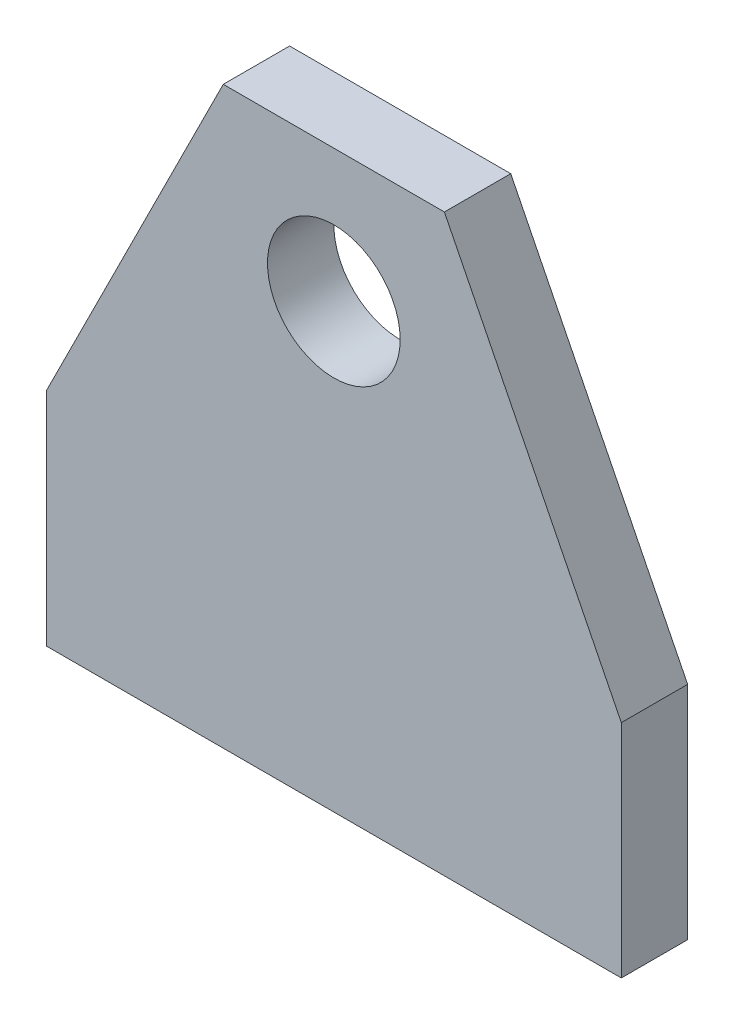
ISO-10303-21;
HEADER;
FILE_DESCRIPTION(('STEP AP214'),'2;1');
FILE_NAME('part.step','',(''),(''),'','','');
FILE_SCHEMA(('AUTOMOTIVE_DESIGN { 1 0 10303 214 1 1 1 1 }'));
ENDSEC;
DATA;
#1=APPLICATION_CONTEXT('core data for automotive mechanical design processes');
#2=APPLICATION_PROTOCOL_DEFINITION('international standard','automotive_design',2000,#1);
#3=PRODUCT_CONTEXT('',#1,'mechanical');
#4=PRODUCT('Part','Part','',(#3));
#5=PRODUCT_RELATED_PRODUCT_CATEGORY('part','',(#4));
#6=PRODUCT_DEFINITION_FORMATION('','',#4);
#7=PRODUCT_DEFINITION_CONTEXT('part definition',#1,'design');
#8=PRODUCT_DEFINITION('design','',#6,#7);
#9=PRODUCT_DEFINITION_SHAPE('','',#8);
#10=(LENGTH_UNIT() NAMED_UNIT(*) SI_UNIT(.MILLI.,.METRE.));
#11=(NAMED_UNIT(*) PLANE_ANGLE_UNIT() SI_UNIT($,.RADIAN.));
#12=(NAMED_UNIT(*) SI_UNIT($,.STERADIAN.) SOLID_ANGLE_UNIT());
#13=UNCERTAINTY_MEASURE_WITH_UNIT(LENGTH_MEASURE(1.E-05),#10,'distance_accuracy_value','');
#14=(GEOMETRIC_REPRESENTATION_CONTEXT(3) GLOBAL_UNCERTAINTY_ASSIGNED_CONTEXT((#13)) GLOBAL_UNIT_ASSIGNED_CONTEXT((#10,
#11,#12)) REPRESENTATION_CONTEXT('',''));
#15=CARTESIAN_POINT('',(0.,0.,0.));
#16=DIRECTION('',(0.,0.,1.));
#17=DIRECTION('',(1.,0.,0.));
#18=AXIS2_PLACEMENT_3D('',#15,#16,#17);
#19=CARTESIAN_POINT('',(41.275,0.,9.525));
#20=DIRECTION('',(0.,0.,-1.));
#21=DIRECTION('',(-1.,0.,0.));
#22=AXIS2_PLACEMENT_3D('',#19,#20,#21);
#23=PLANE('',#22);
#24=DIRECTION('',(0.,-1.,0.));
#25=VECTOR('',#24,1.);
#26=CARTESIAN_POINT('',(41.275,31.75,9.525));
#27=LINE('',#26,#25);
#28=CARTESIAN_POINT('',(41.275,31.75,9.525));
#29=VERTEX_POINT('',#28);
#30=CARTESIAN_POINT('',(41.275,0.,9.525));
#31=VERTEX_POINT('',#30);
#32=EDGE_CURVE('E162',#29,#31,#27,.T.);
#33=ORIENTED_EDGE('',*,*,#32,.F.);
#34=DIRECTION('',(0.447213595499958,-0.894427190999916,0.));
#35=VECTOR('',#34,1.);
#36=CARTESIAN_POINT('',(15.875,82.55,9.525));
#37=LINE('',#36,#35);
#38=CARTESIAN_POINT('',(15.875,82.55,9.525));
#39=VERTEX_POINT('',#38);
#40=EDGE_CURVE('E133',#39,#29,#37,.T.);
#41=ORIENTED_EDGE('',*,*,#40,.F.);
#42=DIRECTION('',(1.,0.,0.));
#43=VECTOR('',#42,1.);
#44=CARTESIAN_POINT('',(-15.875,82.55,9.525));
#45=LINE('',#44,#43);
#46=CARTESIAN_POINT('',(-15.875,82.55,9.525));
#47=VERTEX_POINT('',#46);
#48=EDGE_CURVE('E115',#47,#39,#45,.T.);
#49=ORIENTED_EDGE('',*,*,#48,.F.);
#50=DIRECTION('',(-0.447213595499958,-0.894427190999916,0.));
#51=VECTOR('',#50,1.);
#52=CARTESIAN_POINT('',(-15.875,82.55,9.525));
#53=LINE('',#52,#51);
#54=CARTESIAN_POINT('',(-41.275,31.75,9.525));
#55=VERTEX_POINT('',#54);
#56=EDGE_CURVE('E124',#47,#55,#53,.T.);
#57=ORIENTED_EDGE('',*,*,#56,.T.);
#58=DIRECTION('',(0.,-1.,0.));
#59=VECTOR('',#58,1.);
#60=CARTESIAN_POINT('',(-41.275,31.75,9.525));
#61=LINE('',#60,#59);
#62=CARTESIAN_POINT('',(-41.275,0.,9.525));
#63=VERTEX_POINT('',#62);
#64=EDGE_CURVE('E130',#55,#63,#61,.T.);
#65=ORIENTED_EDGE('',*,*,#64,.T.);
#66=DIRECTION('',(-1.,0.,0.));
#67=VECTOR('',#66,1.);
#68=CARTESIAN_POINT('',(41.275,0.,9.525));
#69=LINE('',#68,#67);
#70=EDGE_CURVE('E212',#31,#63,#69,.T.);
#71=ORIENTED_EDGE('',*,*,#70,.F.);
#72=EDGE_LOOP('',(#33,#41,#49,#57,#65,#71));
#73=FACE_BOUND('',#72,.T.);
#74=CARTESIAN_POINT('',(0.,63.5,9.525));
#75=DIRECTION('',(0.,0.,1.));
#76=DIRECTION('',(1.,0.,0.));
#77=AXIS2_PLACEMENT_3D('',#74,#75,#76);
#78=CIRCLE('',#77,9.525);
#79=CARTESIAN_POINT('',(9.525,63.5,9.525));
#80=VERTEX_POINT('',#79);
#81=EDGE_CURVE('E146',#80,#80,#78,.T.);
#82=ORIENTED_EDGE('',*,*,#81,.F.);
#83=EDGE_LOOP('',(#82));
#84=FACE_BOUND('',#83,.T.);
#85=ADVANCED_FACE('F40',(#73,#84),#23,.F.);
#86=CARTESIAN_POINT('',(41.275,0.,0.));
#87=DIRECTION('',(0.,0.,-1.));
#88=DIRECTION('',(-1.,0.,0.));
#89=AXIS2_PLACEMENT_3D('',#86,#87,#88);
#90=PLANE('',#89);
#91=DIRECTION('',(0.,-1.,0.));
#92=VECTOR('',#91,1.);
#93=CARTESIAN_POINT('',(41.275,31.75,0.));
#94=LINE('',#93,#92);
#95=CARTESIAN_POINT('',(41.275,31.75,0.));
#96=VERTEX_POINT('',#95);
#97=CARTESIAN_POINT('',(41.275,0.,0.));
#98=VERTEX_POINT('',#97);
#99=EDGE_CURVE('E141',#96,#98,#94,.T.);
#100=ORIENTED_EDGE('',*,*,#99,.T.);
#101=DIRECTION('',(-1.,0.,0.));
#102=VECTOR('',#101,1.);
#103=CARTESIAN_POINT('',(41.275,0.,0.));
#104=LINE('',#103,#102);
#105=CARTESIAN_POINT('',(-41.275,0.,0.));
#106=VERTEX_POINT('',#105);
#107=EDGE_CURVE('E145',#98,#106,#104,.T.);
#108=ORIENTED_EDGE('',*,*,#107,.T.);
#109=DIRECTION('',(0.,-1.,0.));
#110=VECTOR('',#109,1.);
#111=CARTESIAN_POINT('',(-41.275,31.75,0.));
#112=LINE('',#111,#110);
#113=CARTESIAN_POINT('',(-41.275,31.75,0.));
#114=VERTEX_POINT('',#113);
#115=EDGE_CURVE('E150',#114,#106,#112,.T.);
#116=ORIENTED_EDGE('',*,*,#115,.F.);
#117=DIRECTION('',(-0.447213595499958,-0.894427190999916,0.));
#118=VECTOR('',#117,1.);
#119=CARTESIAN_POINT('',(-15.875,82.55,0.));
#120=LINE('',#119,#118);
#121=CARTESIAN_POINT('',(-15.875,82.55,0.));
#122=VERTEX_POINT('',#121);
#123=EDGE_CURVE('E154',#122,#114,#120,.T.);
#124=ORIENTED_EDGE('',*,*,#123,.F.);
#125=DIRECTION('',(1.,0.,0.));
#126=VECTOR('',#125,1.);
#127=CARTESIAN_POINT('',(-15.875,82.55,0.));
#128=LINE('',#127,#126);
#129=CARTESIAN_POINT('',(15.875,82.55,0.));
#130=VERTEX_POINT('',#129);
#131=EDGE_CURVE('E117',#122,#130,#128,.T.);
#132=ORIENTED_EDGE('',*,*,#131,.T.);
#133=DIRECTION('',(0.447213595499958,-0.894427190999916,0.));
#134=VECTOR('',#133,1.);
#135=CARTESIAN_POINT('',(15.875,82.55,0.));
#136=LINE('',#135,#134);
#137=EDGE_CURVE('E159',#130,#96,#136,.T.);
#138=ORIENTED_EDGE('',*,*,#137,.T.);
#139=EDGE_LOOP('',(#100,#108,#116,#124,#132,#138));
#140=FACE_BOUND('',#139,.T.);
#141=CARTESIAN_POINT('',(0.,63.5,0.));
#142=DIRECTION('',(0.,0.,1.));
#143=DIRECTION('',(1.,0.,0.));
#144=AXIS2_PLACEMENT_3D('',#141,#142,#143);
#145=CIRCLE('',#144,9.525);
#146=CARTESIAN_POINT('',(9.525,63.5,0.));
#147=VERTEX_POINT('',#146);
#148=EDGE_CURVE('E204',#147,#147,#145,.T.);
#149=ORIENTED_EDGE('',*,*,#148,.T.);
#150=EDGE_LOOP('',(#149));
#151=FACE_BOUND('',#150,.T.);
#152=ADVANCED_FACE('F175',(#140,#151),#90,.T.);
#153=CARTESIAN_POINT('',(41.275,31.75,9.525));
#154=DIRECTION('',(1.,0.,0.));
#155=DIRECTION('',(0.,0.,-1.));
#156=AXIS2_PLACEMENT_3D('',#153,#154,#155);
#157=PLANE('',#156);
#158=ORIENTED_EDGE('',*,*,#99,.F.);
#159=DIRECTION('',(0.,0.,-1.));
#160=VECTOR('',#159,1.);
#161=CARTESIAN_POINT('',(41.275,31.75,9.525));
#162=LINE('',#161,#160);
#163=EDGE_CURVE('E11',#29,#96,#162,.T.);
#164=ORIENTED_EDGE('',*,*,#163,.F.);
#165=ORIENTED_EDGE('',*,*,#32,.T.);
#166=DIRECTION('',(0.,0.,-1.));
#167=VECTOR('',#166,1.);
#168=CARTESIAN_POINT('',(41.275,0.,9.525));
#169=LINE('',#168,#167);
#170=EDGE_CURVE('E44',#31,#98,#169,.T.);
#171=ORIENTED_EDGE('',*,*,#170,.T.);
#172=EDGE_LOOP('',(#158,#164,#165,#171));
#173=FACE_BOUND('',#172,.T.);
#174=ADVANCED_FACE('F42',(#173),#157,.T.);
#175=CARTESIAN_POINT('',(15.875,82.55,9.525));
#176=DIRECTION('',(0.894427190999916,0.447213595499958,0.));
#177=DIRECTION('',(-0.447213595499958,0.894427190999916,0.));
#178=AXIS2_PLACEMENT_3D('',#175,#176,#177);
#179=PLANE('',#178);
#180=ORIENTED_EDGE('',*,*,#137,.F.);
#181=DIRECTION('',(0.,0.,-1.));
#182=VECTOR('',#181,1.);
#183=CARTESIAN_POINT('',(15.875,82.55,9.525));
#184=LINE('',#183,#182);
#185=EDGE_CURVE('E51',#39,#130,#184,.T.);
#186=ORIENTED_EDGE('',*,*,#185,.F.);
#187=ORIENTED_EDGE('',*,*,#40,.T.);
#188=ORIENTED_EDGE('',*,*,#163,.T.);
#189=EDGE_LOOP('',(#180,#186,#187,#188));
#190=FACE_BOUND('',#189,.T.);
#191=ADVANCED_FACE('F177',(#190),#179,.T.);
#192=CARTESIAN_POINT('',(-15.875,82.55,9.525));
#193=DIRECTION('',(0.,1.,0.));
#194=DIRECTION('',(0.,0.,1.));
#195=AXIS2_PLACEMENT_3D('',#192,#193,#194);
#196=PLANE('',#195);
#197=ORIENTED_EDGE('',*,*,#131,.F.);
#198=DIRECTION('',(0.,0.,-1.));
#199=VECTOR('',#198,1.);
#200=CARTESIAN_POINT('',(-15.875,82.55,9.525));
#201=LINE('',#200,#199);
#202=EDGE_CURVE('E111',#47,#122,#201,.T.);
#203=ORIENTED_EDGE('',*,*,#202,.F.);
#204=ORIENTED_EDGE('',*,*,#48,.T.);
#205=ORIENTED_EDGE('',*,*,#185,.T.);
#206=EDGE_LOOP('',(#197,#203,#204,#205));
#207=FACE_BOUND('',#206,.T.);
#208=ADVANCED_FACE('F113',(#207),#196,.T.);
#209=CARTESIAN_POINT('',(-15.875,82.55,9.525));
#210=DIRECTION('',(0.894427190999916,-0.447213595499958,0.));
#211=DIRECTION('',(0.447213595499958,0.894427190999916,0.));
#212=AXIS2_PLACEMENT_3D('',#209,#210,#211);
#213=PLANE('',#212);
#214=ORIENTED_EDGE('',*,*,#123,.T.);
#215=DIRECTION('',(0.,0.,-1.));
#216=VECTOR('',#215,1.);
#217=CARTESIAN_POINT('',(-41.275,31.75,9.525));
#218=LINE('',#217,#216);
#219=EDGE_CURVE('E121',#55,#114,#218,.T.);
#220=ORIENTED_EDGE('',*,*,#219,.F.);
#221=ORIENTED_EDGE('',*,*,#56,.F.);
#222=ORIENTED_EDGE('',*,*,#202,.T.);
#223=EDGE_LOOP('',(#214,#220,#221,#222));
#224=FACE_BOUND('',#223,.T.);
#225=ADVANCED_FACE('F125',(#224),#213,.F.);
#226=CARTESIAN_POINT('',(-41.275,31.75,9.525));
#227=DIRECTION('',(1.,0.,0.));
#228=DIRECTION('',(0.,0.,-1.));
#229=AXIS2_PLACEMENT_3D('',#226,#227,#228);
#230=PLANE('',#229);
#231=ORIENTED_EDGE('',*,*,#115,.T.);
#232=DIRECTION('',(0.,0.,-1.));
#233=VECTOR('',#232,1.);
#234=CARTESIAN_POINT('',(-41.275,0.,9.525));
#235=LINE('',#234,#233);
#236=EDGE_CURVE('E167',#63,#106,#235,.T.);
#237=ORIENTED_EDGE('',*,*,#236,.F.);
#238=ORIENTED_EDGE('',*,*,#64,.F.);
#239=ORIENTED_EDGE('',*,*,#219,.T.);
#240=EDGE_LOOP('',(#231,#237,#238,#239));
#241=FACE_BOUND('',#240,.T.);
#242=ADVANCED_FACE('F198',(#241),#230,.F.);
#243=CARTESIAN_POINT('',(41.275,0.,9.525));
#244=DIRECTION('',(0.,-1.,0.));
#245=DIRECTION('',(0.,0.,-1.));
#246=AXIS2_PLACEMENT_3D('',#243,#244,#245);
#247=PLANE('',#246);
#248=ORIENTED_EDGE('',*,*,#107,.F.);
#249=ORIENTED_EDGE('',*,*,#170,.F.);
#250=ORIENTED_EDGE('',*,*,#70,.T.);
#251=ORIENTED_EDGE('',*,*,#236,.T.);
#252=EDGE_LOOP('',(#248,#249,#250,#251));
#253=FACE_BOUND('',#252,.T.);
#254=ADVANCED_FACE('F172',(#253),#247,.T.);
#255=CARTESIAN_POINT('',(0.,63.5,9.525));
#256=DIRECTION('',(0.,0.,-1.));
#257=DIRECTION('',(-1.,0.,0.));
#258=AXIS2_PLACEMENT_3D('',#255,#256,#257);
#259=CYLINDRICAL_SURFACE('',#258,9.525);
#260=ORIENTED_EDGE('',*,*,#81,.T.);
#261=EDGE_LOOP('',(#260));
#262=FACE_BOUND('',#261,.T.);
#263=ORIENTED_EDGE('',*,*,#148,.F.);
#264=EDGE_LOOP('',(#263));
#265=FACE_BOUND('',#264,.T.);
#266=ADVANCED_FACE('F192',(#262,#265),#259,.F.);
#267=CLOSED_SHELL('',(#85,#152,#174,#191,#208,#225,#242,#254,#266));
#268=MANIFOLD_SOLID_BREP('B2',#267);
#269=ADVANCED_BREP_SHAPE_REPRESENTATION('',(#18,#268),#14);
#270=SHAPE_DEFINITION_REPRESENTATION(#9,#269);
ENDSEC;
END-ISO-10303-21;
